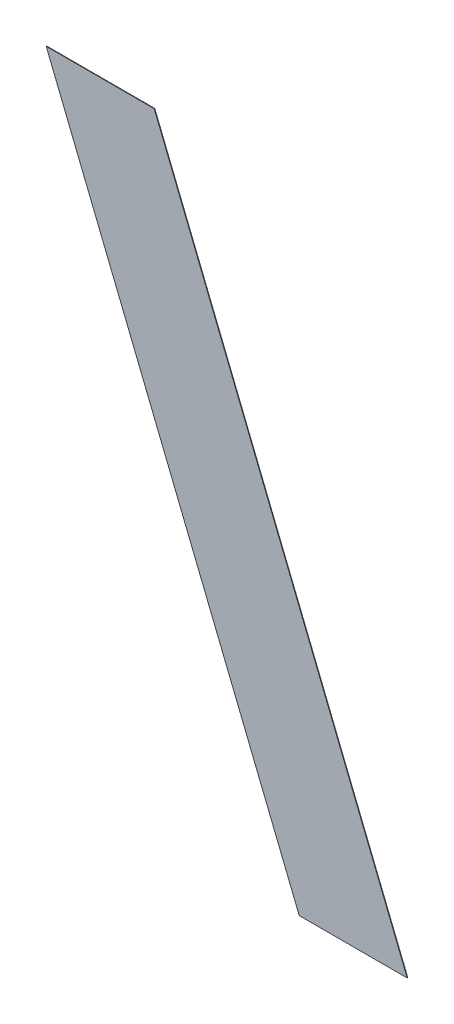
ISO-10303-21;
HEADER;
FILE_DESCRIPTION(('STEP AP214'),'2;1');
FILE_NAME('part.step','',(''),(''),'','','');
FILE_SCHEMA(('AUTOMOTIVE_DESIGN { 1 0 10303 214 1 1 1 1 }'));
ENDSEC;
DATA;
#1=APPLICATION_CONTEXT('core data for automotive mechanical design processes');
#2=APPLICATION_PROTOCOL_DEFINITION('international standard','automotive_design',2000,#1);
#3=PRODUCT_CONTEXT('',#1,'mechanical');
#4=PRODUCT('Part','Part','',(#3));
#5=PRODUCT_RELATED_PRODUCT_CATEGORY('part','',(#4));
#6=PRODUCT_DEFINITION_FORMATION('','',#4);
#7=PRODUCT_DEFINITION_CONTEXT('part definition',#1,'design');
#8=PRODUCT_DEFINITION('design','',#6,#7);
#9=PRODUCT_DEFINITION_SHAPE('','',#8);
#10=(LENGTH_UNIT() NAMED_UNIT(*) SI_UNIT(.MILLI.,.METRE.));
#11=(NAMED_UNIT(*) PLANE_ANGLE_UNIT() SI_UNIT($,.RADIAN.));
#12=(NAMED_UNIT(*) SI_UNIT($,.STERADIAN.) SOLID_ANGLE_UNIT());
#13=UNCERTAINTY_MEASURE_WITH_UNIT(LENGTH_MEASURE(1.E-05),#10,'distance_accuracy_value','');
#14=(GEOMETRIC_REPRESENTATION_CONTEXT(3) GLOBAL_UNCERTAINTY_ASSIGNED_CONTEXT((#13)) GLOBAL_UNIT_ASSIGNED_CONTEXT((#10,
#11,#12)) REPRESENTATION_CONTEXT('',''));
#15=CARTESIAN_POINT('',(0.,0.,0.));
#16=DIRECTION('',(0.,0.,1.));
#17=DIRECTION('',(1.,0.,0.));
#18=AXIS2_PLACEMENT_3D('',#15,#16,#17);
#19=CARTESIAN_POINT('',(0.446343713083,-0.192580169588,0.0009));
#20=DIRECTION('',(0.,0.,-1.));
#21=DIRECTION('',(-1.,0.,0.));
#22=AXIS2_PLACEMENT_3D('',#19,#20,#21);
#23=PLANE('',#22);
#24=DIRECTION('',(-0.37460659341586,0.927183854566809,0.));
#25=VECTOR('',#24,1.);
#26=CARTESIAN_POINT('',(0.4791347248085,-0.192580169588,0.0009));
#27=LINE('',#26,#25);
#28=CARTESIAN_POINT('',(0.4791347248085,-0.192580169588,0.0009));
#29=VERTEX_POINT('',#28);
#30=CARTESIAN_POINT('',(0.4331727013575,-0.078820169588,0.0009));
#31=VERTEX_POINT('',#30);
#32=EDGE_CURVE('E11',#29,#31,#27,.T.);
#33=ORIENTED_EDGE('',*,*,#32,.F.);
#34=DIRECTION('',(1.,0.,0.));
#35=VECTOR('',#34,1.);
#36=CARTESIAN_POINT('',(0.4595147248085,-0.192580169588,0.0009));
#37=LINE('',#36,#35);
#38=CARTESIAN_POINT('',(0.4595147248085,-0.192580169588,0.0009));
#39=VERTEX_POINT('',#38);
#40=EDGE_CURVE('E24',#39,#29,#37,.T.);
#41=ORIENTED_EDGE('',*,*,#40,.F.);
#42=DIRECTION('',(0.37460659341586,-0.927183854566809,0.));
#43=VECTOR('',#42,1.);
#44=CARTESIAN_POINT('',(0.4135527013575,-0.078820169588,0.0009));
#45=LINE('',#44,#43);
#46=CARTESIAN_POINT('',(0.4135527013576,-0.078820169588,0.0009));
#47=VERTEX_POINT('',#46);
#48=EDGE_CURVE('E70',#47,#39,#45,.T.);
#49=ORIENTED_EDGE('',*,*,#48,.F.);
#50=DIRECTION('',(-1.,0.,0.));
#51=VECTOR('',#50,1.);
#52=CARTESIAN_POINT('',(0.4331727013575,-0.078820169588,0.0009));
#53=LINE('',#52,#51);
#54=EDGE_CURVE('E86',#31,#47,#53,.T.);
#55=ORIENTED_EDGE('',*,*,#54,.F.);
#56=EDGE_LOOP('',(#33,#41,#49,#55));
#57=FACE_BOUND('',#56,.T.);
#58=ADVANCED_FACE('F17',(#57),#23,.T.);
#59=CARTESIAN_POINT('',(0.456153713083,-0.135700169588,0.0009));
#60=DIRECTION('',(-0.927183854566809,-0.37460659341586,0.));
#61=DIRECTION('',(0.,0.,1.));
#62=AXIS2_PLACEMENT_3D('',#59,#60,#61);
#63=PLANE('',#62);
#64=DIRECTION('',(0.37460659341586,-0.927183854566809,0.));
#65=VECTOR('',#64,1.);
#66=CARTESIAN_POINT('',(0.4331727013575,-0.078820169588,0.001));
#67=LINE('',#66,#65);
#68=CARTESIAN_POINT('',(0.4331727013575,-0.078820169588,0.001));
#69=VERTEX_POINT('',#68);
#70=CARTESIAN_POINT('',(0.4791347248085,-0.192580169588,0.001));
#71=VERTEX_POINT('',#70);
#72=EDGE_CURVE('E84',#69,#71,#67,.T.);
#73=ORIENTED_EDGE('',*,*,#72,.T.);
#74=DIRECTION('',(0.,0.,-1.));
#75=VECTOR('',#74,1.);
#76=CARTESIAN_POINT('',(0.4791347248085,-0.192580169588,0.001));
#77=LINE('',#76,#75);
#78=EDGE_CURVE('E75',#71,#29,#77,.T.);
#79=ORIENTED_EDGE('',*,*,#78,.T.);
#80=ORIENTED_EDGE('',*,*,#32,.T.);
#81=DIRECTION('',(0.,0.,-1.));
#82=VECTOR('',#81,1.);
#83=CARTESIAN_POINT('',(0.4331727013575,-0.078820169588,0.001));
#84=LINE('',#83,#82);
#85=EDGE_CURVE('E80',#69,#31,#84,.T.);
#86=ORIENTED_EDGE('',*,*,#85,.F.);
#87=EDGE_LOOP('',(#73,#79,#80,#86));
#88=FACE_BOUND('',#87,.T.);
#89=ADVANCED_FACE('F89',(#88),#63,.F.);
#90=CARTESIAN_POINT('',(0.42336270135755,-0.078820169588,0.0009));
#91=DIRECTION('',(0.,-1.,0.));
#92=DIRECTION('',(0.,0.,-1.));
#93=AXIS2_PLACEMENT_3D('',#90,#91,#92);
#94=PLANE('',#93);
#95=DIRECTION('',(1.,0.,0.));
#96=VECTOR('',#95,1.);
#97=CARTESIAN_POINT('',(0.4135527013576,-0.078820169588,0.001));
#98=LINE('',#97,#96);
#99=CARTESIAN_POINT('',(0.4135527013576,-0.078820169588,0.001));
#100=VERTEX_POINT('',#99);
#101=EDGE_CURVE('E60',#100,#69,#98,.T.);
#102=ORIENTED_EDGE('',*,*,#101,.T.);
#103=ORIENTED_EDGE('',*,*,#85,.T.);
#104=ORIENTED_EDGE('',*,*,#54,.T.);
#105=DIRECTION('',(0.,0.,-1.));
#106=VECTOR('',#105,1.);
#107=CARTESIAN_POINT('',(0.4135527013576,-0.078820169588,0.001));
#108=LINE('',#107,#106);
#109=EDGE_CURVE('E64',#100,#47,#108,.T.);
#110=ORIENTED_EDGE('',*,*,#109,.F.);
#111=EDGE_LOOP('',(#102,#103,#104,#110));
#112=FACE_BOUND('',#111,.T.);
#113=ADVANCED_FACE('F91',(#112),#94,.F.);
#114=CARTESIAN_POINT('',(0.436533713083,-0.135700169588,0.0009));
#115=DIRECTION('',(0.927183854566809,0.37460659341586,0.));
#116=DIRECTION('',(0.,0.,-1.));
#117=AXIS2_PLACEMENT_3D('',#114,#115,#116);
#118=PLANE('',#117);
#119=DIRECTION('',(-0.37460659341586,0.927183854566809,0.));
#120=VECTOR('',#119,1.);
#121=CARTESIAN_POINT('',(0.4595147248085,-0.192580169588,0.001));
#122=LINE('',#121,#120);
#123=CARTESIAN_POINT('',(0.4595147248085,-0.192580169588,0.001));
#124=VERTEX_POINT('',#123);
#125=EDGE_CURVE('E54',#124,#100,#122,.T.);
#126=ORIENTED_EDGE('',*,*,#125,.T.);
#127=ORIENTED_EDGE('',*,*,#109,.T.);
#128=ORIENTED_EDGE('',*,*,#48,.T.);
#129=DIRECTION('',(0.,0.,-1.));
#130=VECTOR('',#129,1.);
#131=CARTESIAN_POINT('',(0.4595147248085,-0.192580169588,0.001));
#132=LINE('',#131,#130);
#133=EDGE_CURVE('E65',#124,#39,#132,.T.);
#134=ORIENTED_EDGE('',*,*,#133,.F.);
#135=EDGE_LOOP('',(#126,#127,#128,#134));
#136=FACE_BOUND('',#135,.T.);
#137=ADVANCED_FACE('F69',(#136),#118,.F.);
#138=CARTESIAN_POINT('',(0.4693247248085,-0.192580169588,0.0009));
#139=DIRECTION('',(0.,1.,0.));
#140=DIRECTION('',(0.,0.,1.));
#141=AXIS2_PLACEMENT_3D('',#138,#139,#140);
#142=PLANE('',#141);
#143=DIRECTION('',(-1.,0.,0.));
#144=VECTOR('',#143,1.);
#145=CARTESIAN_POINT('',(0.4791347248085,-0.192580169588,0.001));
#146=LINE('',#145,#144);
#147=EDGE_CURVE('E58',#71,#124,#146,.T.);
#148=ORIENTED_EDGE('',*,*,#147,.T.);
#149=ORIENTED_EDGE('',*,*,#133,.T.);
#150=ORIENTED_EDGE('',*,*,#40,.T.);
#151=ORIENTED_EDGE('',*,*,#78,.F.);
#152=EDGE_LOOP('',(#148,#149,#150,#151));
#153=FACE_BOUND('',#152,.T.);
#154=ADVANCED_FACE('F74',(#153),#142,.F.);
#155=CARTESIAN_POINT('',(0.446343713083,-0.192580169588,0.001));
#156=DIRECTION('',(0.,0.,-1.));
#157=DIRECTION('',(-1.,0.,0.));
#158=AXIS2_PLACEMENT_3D('',#155,#156,#157);
#159=PLANE('',#158);
#160=ORIENTED_EDGE('',*,*,#125,.F.);
#161=ORIENTED_EDGE('',*,*,#147,.F.);
#162=ORIENTED_EDGE('',*,*,#72,.F.);
#163=ORIENTED_EDGE('',*,*,#101,.F.);
#164=EDGE_LOOP('',(#160,#161,#162,#163));
#165=FACE_BOUND('',#164,.T.);
#166=ADVANCED_FACE('F56',(#165),#159,.F.);
#167=CLOSED_SHELL('',(#58,#89,#113,#137,#154,#166));
#168=MANIFOLD_SOLID_BREP('B1',#167);
#169=ADVANCED_BREP_SHAPE_REPRESENTATION('',(#18,#168),#14);
#170=SHAPE_DEFINITION_REPRESENTATION(#9,#169);
ENDSEC;
END-ISO-10303-21;
